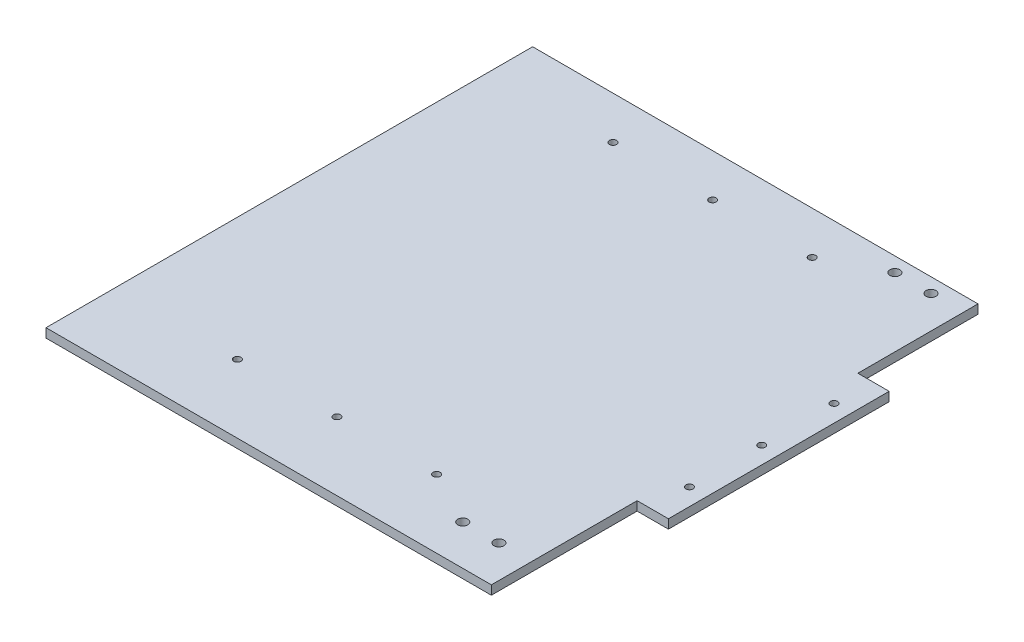
ISO-10303-21;
HEADER;
FILE_DESCRIPTION(('STEP AP214'),'2;1');
FILE_NAME('part.step','',(''),(''),'','','');
FILE_SCHEMA(('AUTOMOTIVE_DESIGN { 1 0 10303 214 1 1 1 1 }'));
ENDSEC;
DATA;
#1=APPLICATION_CONTEXT('core data for automotive mechanical design processes');
#2=APPLICATION_PROTOCOL_DEFINITION('international standard','automotive_design',2000,#1);
#3=PRODUCT_CONTEXT('',#1,'mechanical');
#4=PRODUCT('Part','Part','',(#3));
#5=PRODUCT_RELATED_PRODUCT_CATEGORY('part','',(#4));
#6=PRODUCT_DEFINITION_FORMATION('','',#4);
#7=PRODUCT_DEFINITION_CONTEXT('part definition',#1,'design');
#8=PRODUCT_DEFINITION('design','',#6,#7);
#9=PRODUCT_DEFINITION_SHAPE('','',#8);
#10=(LENGTH_UNIT() NAMED_UNIT(*) SI_UNIT(.MILLI.,.METRE.));
#11=(NAMED_UNIT(*) PLANE_ANGLE_UNIT() SI_UNIT($,.RADIAN.));
#12=(NAMED_UNIT(*) SI_UNIT($,.STERADIAN.) SOLID_ANGLE_UNIT());
#13=UNCERTAINTY_MEASURE_WITH_UNIT(LENGTH_MEASURE(1.E-05),#10,'distance_accuracy_value','');
#14=(GEOMETRIC_REPRESENTATION_CONTEXT(3) GLOBAL_UNCERTAINTY_ASSIGNED_CONTEXT((#13)) GLOBAL_UNIT_ASSIGNED_CONTEXT((#10,
#11,#12)) REPRESENTATION_CONTEXT('',''));
#15=CARTESIAN_POINT('',(0.,0.,0.));
#16=DIRECTION('',(0.,0.,1.));
#17=DIRECTION('',(1.,0.,0.));
#18=AXIS2_PLACEMENT_3D('',#15,#16,#17);
#19=CARTESIAN_POINT('',(156.499999999998,-6.35,171.));
#20=DIRECTION('',(1.,0.,0.));
#21=DIRECTION('',(0.,0.,-1.));
#22=AXIS2_PLACEMENT_3D('',#19,#20,#21);
#23=PLANE('',#22);
#24=DIRECTION('',(0.,0.,-1.));
#25=VECTOR('',#24,1.);
#26=CARTESIAN_POINT('',(156.499999999998,-6.35,171.));
#27=LINE('',#26,#25);
#28=CARTESIAN_POINT('',(156.499999999998,-6.35,171.));
#29=VERTEX_POINT('',#28);
#30=CARTESIAN_POINT('',(156.499999999998,-6.35,68.570201764885));
#31=VERTEX_POINT('',#30);
#32=EDGE_CURVE('E148',#29,#31,#27,.T.);
#33=ORIENTED_EDGE('',*,*,#32,.T.);
#34=DIRECTION('',(0.,1.,0.));
#35=VECTOR('',#34,1.);
#36=CARTESIAN_POINT('',(156.499999999998,-6.35,68.570201764885));
#37=LINE('',#36,#35);
#38=CARTESIAN_POINT('',(156.499999999998,0.,68.570201764885));
#39=VERTEX_POINT('',#38);
#40=EDGE_CURVE('E130',#31,#39,#37,.T.);
#41=ORIENTED_EDGE('',*,*,#40,.T.);
#42=DIRECTION('',(0.,0.,-1.));
#43=VECTOR('',#42,1.);
#44=CARTESIAN_POINT('',(156.499999999998,0.,171.));
#45=LINE('',#44,#43);
#46=CARTESIAN_POINT('',(156.499999999998,0.,171.));
#47=VERTEX_POINT('',#46);
#48=EDGE_CURVE('E158',#47,#39,#45,.T.);
#49=ORIENTED_EDGE('',*,*,#48,.F.);
#50=DIRECTION('',(0.,1.,0.));
#51=VECTOR('',#50,1.);
#52=CARTESIAN_POINT('',(156.499999999998,-6.35,171.));
#53=LINE('',#52,#51);
#54=EDGE_CURVE('E11',#29,#47,#53,.T.);
#55=ORIENTED_EDGE('',*,*,#54,.F.);
#56=EDGE_LOOP('',(#33,#41,#49,#55));
#57=FACE_BOUND('',#56,.T.);
#58=ADVANCED_FACE('F37',(#57),#23,.T.);
#59=DIRECTION('',(0.,1.,0.));
#60=VECTOR('',#59,1.);
#61=CARTESIAN_POINT('',(156.499999999998,-6.35,-86.570201764878));
#62=LINE('',#61,#60);
#63=CARTESIAN_POINT('',(156.499999999998,-6.35,-86.570201764878));
#64=VERTEX_POINT('',#63);
#65=CARTESIAN_POINT('',(156.499999999998,0.,-86.570201764878));
#66=VERTEX_POINT('',#65);
#67=EDGE_CURVE('E145',#64,#66,#62,.T.);
#68=ORIENTED_EDGE('',*,*,#67,.F.);
#69=CARTESIAN_POINT('',(156.499999999998,-6.35,-171.));
#70=VERTEX_POINT('',#69);
#71=EDGE_CURVE('E88',#64,#70,#27,.T.);
#72=ORIENTED_EDGE('',*,*,#71,.T.);
#73=DIRECTION('',(0.,1.,0.));
#74=VECTOR('',#73,1.);
#75=CARTESIAN_POINT('',(156.499999999998,-6.35,-171.));
#76=LINE('',#75,#74);
#77=CARTESIAN_POINT('',(156.499999999998,0.,-171.));
#78=VERTEX_POINT('',#77);
#79=EDGE_CURVE('E41',#70,#78,#76,.T.);
#80=ORIENTED_EDGE('',*,*,#79,.T.);
#81=EDGE_CURVE('E144',#66,#78,#45,.T.);
#82=ORIENTED_EDGE('',*,*,#81,.F.);
#83=EDGE_LOOP('',(#68,#72,#80,#82));
#84=FACE_BOUND('',#83,.T.);
#85=ADVANCED_FACE('F39',(#84),#23,.T.);
#86=CARTESIAN_POINT('',(-156.500000000002,-6.35,171.));
#87=DIRECTION('',(0.,0.,1.));
#88=DIRECTION('',(1.,0.,0.));
#89=AXIS2_PLACEMENT_3D('',#86,#87,#88);
#90=PLANE('',#89);
#91=DIRECTION('',(1.,0.,0.));
#92=VECTOR('',#91,1.);
#93=CARTESIAN_POINT('',(-156.500000000002,0.,171.));
#94=LINE('',#93,#92);
#95=CARTESIAN_POINT('',(-156.500000000002,0.,171.));
#96=VERTEX_POINT('',#95);
#97=EDGE_CURVE('E167',#96,#47,#94,.T.);
#98=ORIENTED_EDGE('',*,*,#97,.F.);
#99=DIRECTION('',(0.,1.,0.));
#100=VECTOR('',#99,1.);
#101=CARTESIAN_POINT('',(-156.500000000002,-6.35,171.));
#102=LINE('',#101,#100);
#103=CARTESIAN_POINT('',(-156.500000000002,-6.35,171.));
#104=VERTEX_POINT('',#103);
#105=EDGE_CURVE('E46',#104,#96,#102,.T.);
#106=ORIENTED_EDGE('',*,*,#105,.F.);
#107=DIRECTION('',(1.,0.,0.));
#108=VECTOR('',#107,1.);
#109=CARTESIAN_POINT('',(-156.500000000002,-6.35,171.));
#110=LINE('',#109,#108);
#111=EDGE_CURVE('E156',#104,#29,#110,.T.);
#112=ORIENTED_EDGE('',*,*,#111,.T.);
#113=ORIENTED_EDGE('',*,*,#54,.T.);
#114=EDGE_LOOP('',(#98,#106,#112,#113));
#115=FACE_BOUND('',#114,.T.);
#116=ADVANCED_FACE('F187',(#115),#90,.T.);
#117=CARTESIAN_POINT('',(-156.500000000002,-6.35,171.));
#118=DIRECTION('',(-1.,0.,0.));
#119=DIRECTION('',(0.,0.,1.));
#120=AXIS2_PLACEMENT_3D('',#117,#118,#119);
#121=PLANE('',#120);
#122=DIRECTION('',(0.,0.,1.));
#123=VECTOR('',#122,1.);
#124=CARTESIAN_POINT('',(-156.500000000002,0.,171.));
#125=LINE('',#124,#123);
#126=CARTESIAN_POINT('',(-156.500000000002,0.,-171.));
#127=VERTEX_POINT('',#126);
#128=EDGE_CURVE('E164',#127,#96,#125,.T.);
#129=ORIENTED_EDGE('',*,*,#128,.F.);
#130=DIRECTION('',(0.,1.,0.));
#131=VECTOR('',#130,1.);
#132=CARTESIAN_POINT('',(-156.500000000002,-6.35,-171.));
#133=LINE('',#132,#131);
#134=CARTESIAN_POINT('',(-156.500000000002,-6.35,-171.));
#135=VERTEX_POINT('',#134);
#136=EDGE_CURVE('E170',#135,#127,#133,.T.);
#137=ORIENTED_EDGE('',*,*,#136,.F.);
#138=DIRECTION('',(0.,0.,1.));
#139=VECTOR('',#138,1.);
#140=CARTESIAN_POINT('',(-156.500000000002,-6.35,171.));
#141=LINE('',#140,#139);
#142=EDGE_CURVE('E153',#135,#104,#141,.T.);
#143=ORIENTED_EDGE('',*,*,#142,.T.);
#144=ORIENTED_EDGE('',*,*,#105,.T.);
#145=EDGE_LOOP('',(#129,#137,#143,#144));
#146=FACE_BOUND('',#145,.T.);
#147=ADVANCED_FACE('F186',(#146),#121,.T.);
#148=CARTESIAN_POINT('',(-156.500000000002,-6.35,-171.));
#149=DIRECTION('',(0.,0.,-1.));
#150=DIRECTION('',(-1.,0.,0.));
#151=AXIS2_PLACEMENT_3D('',#148,#149,#150);
#152=PLANE('',#151);
#153=DIRECTION('',(-1.,0.,0.));
#154=VECTOR('',#153,1.);
#155=CARTESIAN_POINT('',(-156.500000000002,0.,-171.));
#156=LINE('',#155,#154);
#157=EDGE_CURVE('E161',#78,#127,#156,.T.);
#158=ORIENTED_EDGE('',*,*,#157,.F.);
#159=ORIENTED_EDGE('',*,*,#79,.F.);
#160=DIRECTION('',(-1.,0.,0.));
#161=VECTOR('',#160,1.);
#162=CARTESIAN_POINT('',(-156.500000000002,-6.35,-171.));
#163=LINE('',#162,#161);
#164=EDGE_CURVE('E150',#70,#135,#163,.T.);
#165=ORIENTED_EDGE('',*,*,#164,.T.);
#166=ORIENTED_EDGE('',*,*,#136,.T.);
#167=EDGE_LOOP('',(#158,#159,#165,#166));
#168=FACE_BOUND('',#167,.T.);
#169=ADVANCED_FACE('F176',(#168),#152,.T.);
#170=CARTESIAN_POINT('',(0.,-6.35,0.));
#171=DIRECTION('',(0.,-1.,0.));
#172=DIRECTION('',(0.,0.,-1.));
#173=AXIS2_PLACEMENT_3D('',#170,#171,#172);
#174=PLANE('',#173);
#175=CARTESIAN_POINT('',(133.639999999999,-6.35000000000039,-160.839999999994));
#176=DIRECTION('',(0.,-1.,0.));
#177=DIRECTION('',(0.,0.,-1.));
#178=AXIS2_PLACEMENT_3D('',#175,#176,#177);
#179=CIRCLE('',#178,3.49999999999999);
#180=CARTESIAN_POINT('',(133.639999999999,-6.35000000000026,-164.339999999994));
#181=VERTEX_POINT('',#180);
#182=EDGE_CURVE('E275',#181,#181,#179,.T.);
#183=ORIENTED_EDGE('',*,*,#182,.F.);
#184=EDGE_LOOP('',(#183));
#185=FACE_BOUND('',#184,.T.);
#186=CARTESIAN_POINT('',(108.239999999999,-6.35000000000039,-160.839999999994));
#187=DIRECTION('',(0.,-1.,0.));
#188=DIRECTION('',(0.,0.,-1.));
#189=AXIS2_PLACEMENT_3D('',#186,#187,#188);
#190=CIRCLE('',#189,3.50000000000001);
#191=CARTESIAN_POINT('',(108.239999999999,-6.35000000000026,-164.339999999994));
#192=VERTEX_POINT('',#191);
#193=EDGE_CURVE('E279',#192,#192,#190,.T.);
#194=ORIENTED_EDGE('',*,*,#193,.F.);
#195=EDGE_LOOP('',(#194));
#196=FACE_BOUND('',#195,.T.);
#197=CARTESIAN_POINT('',(133.639999999998,-6.35,142.84));
#198=DIRECTION('',(0.,1.,0.));
#199=DIRECTION('',(0.,0.,1.));
#200=AXIS2_PLACEMENT_3D('',#197,#198,#199);
#201=CIRCLE('',#200,3.49999999999999);
#202=CARTESIAN_POINT('',(133.639999999998,-6.35,146.34));
#203=VERTEX_POINT('',#202);
#204=EDGE_CURVE('E289',#203,#203,#201,.T.);
#205=ORIENTED_EDGE('',*,*,#204,.T.);
#206=EDGE_LOOP('',(#205));
#207=FACE_BOUND('',#206,.T.);
#208=CARTESIAN_POINT('',(108.239999999998,-6.35,142.84));
#209=DIRECTION('',(0.,1.,0.));
#210=DIRECTION('',(0.,0.,1.));
#211=AXIS2_PLACEMENT_3D('',#208,#209,#210);
#212=CIRCLE('',#211,3.50000000000001);
#213=CARTESIAN_POINT('',(108.239999999998,-6.35,146.34));
#214=VERTEX_POINT('',#213);
#215=EDGE_CURVE('E281',#214,#214,#212,.T.);
#216=ORIENTED_EDGE('',*,*,#215,.T.);
#217=EDGE_LOOP('',(#216));
#218=FACE_BOUND('',#217,.T.);
#219=CARTESIAN_POINT('',(-70.,-6.35,123.000000000004));
#220=DIRECTION('',(0.,1.,0.));
#221=DIRECTION('',(0.,0.,1.));
#222=AXIS2_PLACEMENT_3D('',#219,#220,#221);
#223=CIRCLE('',#222,2.5);
#224=CARTESIAN_POINT('',(-70.,-6.35,125.500000000004));
#225=VERTEX_POINT('',#224);
#226=EDGE_CURVE('E311',#225,#225,#223,.T.);
#227=ORIENTED_EDGE('',*,*,#226,.T.);
#228=EDGE_LOOP('',(#227));
#229=FACE_BOUND('',#228,.T.);
#230=CARTESIAN_POINT('',(70.,-6.35,123.000000000004));
#231=DIRECTION('',(0.,1.,0.));
#232=DIRECTION('',(0.,0.,-1.));
#233=AXIS2_PLACEMENT_3D('',#230,#231,#232);
#234=CIRCLE('',#233,2.5);
#235=CARTESIAN_POINT('',(70.,-6.35,120.500000000004));
#236=VERTEX_POINT('',#235);
#237=EDGE_CURVE('E317',#236,#236,#234,.T.);
#238=ORIENTED_EDGE('',*,*,#237,.T.);
#239=EDGE_LOOP('',(#238));
#240=FACE_BOUND('',#239,.T.);
#241=CARTESIAN_POINT('',(-70.,-6.35,-140.999999999996));
#242=DIRECTION('',(0.,1.,0.));
#243=DIRECTION('',(0.,0.,-1.));
#244=AXIS2_PLACEMENT_3D('',#241,#242,#243);
#245=CIRCLE('',#244,2.5);
#246=CARTESIAN_POINT('',(-70.,-6.35,-143.499999999996));
#247=VERTEX_POINT('',#246);
#248=EDGE_CURVE('E323',#247,#247,#245,.T.);
#249=ORIENTED_EDGE('',*,*,#248,.T.);
#250=EDGE_LOOP('',(#249));
#251=FACE_BOUND('',#250,.T.);
#252=CARTESIAN_POINT('',(0.,-6.35,-140.999999999996));
#253=DIRECTION('',(0.,1.,0.));
#254=DIRECTION('',(0.,0.,-1.));
#255=AXIS2_PLACEMENT_3D('',#252,#253,#254);
#256=CIRCLE('',#255,2.49999999999999);
#257=CARTESIAN_POINT('',(0.,-6.35,-143.499999999996));
#258=VERTEX_POINT('',#257);
#259=EDGE_CURVE('E304',#258,#258,#256,.T.);
#260=ORIENTED_EDGE('',*,*,#259,.T.);
#261=EDGE_LOOP('',(#260));
#262=FACE_BOUND('',#261,.T.);
#263=CARTESIAN_POINT('',(70.,-6.35,-140.999999999996));
#264=DIRECTION('',(0.,1.,0.));
#265=DIRECTION('',(0.,0.,1.));
#266=AXIS2_PLACEMENT_3D('',#263,#264,#265);
#267=CIRCLE('',#266,2.5);
#268=CARTESIAN_POINT('',(70.,-6.35,-138.499999999996));
#269=VERTEX_POINT('',#268);
#270=EDGE_CURVE('E292',#269,#269,#267,.T.);
#271=ORIENTED_EDGE('',*,*,#270,.T.);
#272=EDGE_LOOP('',(#271));
#273=FACE_BOUND('',#272,.T.);
#274=CARTESIAN_POINT('',(0.,-6.35,123.000000000004));
#275=DIRECTION('',(0.,1.,0.));
#276=DIRECTION('',(0.,0.,1.));
#277=AXIS2_PLACEMENT_3D('',#274,#275,#276);
#278=CIRCLE('',#277,2.5);
#279=CARTESIAN_POINT('',(0.,-6.35,125.500000000004));
#280=VERTEX_POINT('',#279);
#281=EDGE_CURVE('E331',#280,#280,#278,.T.);
#282=ORIENTED_EDGE('',*,*,#281,.T.);
#283=EDGE_LOOP('',(#282));
#284=FACE_BOUND('',#283,.T.);
#285=ORIENTED_EDGE('',*,*,#32,.F.);
#286=ORIENTED_EDGE('',*,*,#111,.F.);
#287=ORIENTED_EDGE('',*,*,#142,.F.);
#288=ORIENTED_EDGE('',*,*,#164,.F.);
#289=ORIENTED_EDGE('',*,*,#71,.F.);
#290=DIRECTION('',(-1.,0.,0.));
#291=VECTOR('',#290,1.);
#292=CARTESIAN_POINT('',(178.499999999998,-6.35,-86.570201764878));
#293=LINE('',#292,#291);
#294=CARTESIAN_POINT('',(178.499999999998,-6.35,-86.570201764878));
#295=VERTEX_POINT('',#294);
#296=EDGE_CURVE('E120',#295,#64,#293,.T.);
#297=ORIENTED_EDGE('',*,*,#296,.F.);
#298=DIRECTION('',(0.,0.,-1.));
#299=VECTOR('',#298,1.);
#300=CARTESIAN_POINT('',(178.499999999998,-6.35,68.570201764885));
#301=LINE('',#300,#299);
#302=CARTESIAN_POINT('',(178.499999999998,-6.35,68.570201764885));
#303=VERTEX_POINT('',#302);
#304=EDGE_CURVE('E115',#303,#295,#301,.T.);
#305=ORIENTED_EDGE('',*,*,#304,.F.);
#306=DIRECTION('',(1.,0.,0.));
#307=VECTOR('',#306,1.);
#308=CARTESIAN_POINT('',(156.499999999998,-6.35,68.570201764885));
#309=LINE('',#308,#307);
#310=EDGE_CURVE('E127',#31,#303,#309,.T.);
#311=ORIENTED_EDGE('',*,*,#310,.F.);
#312=EDGE_LOOP('',(#285,#286,#287,#288,#289,#297,#305,#311));
#313=FACE_BOUND('',#312,.T.);
#314=CARTESIAN_POINT('',(166.499999999998,-6.35,-59.7999999999965));
#315=DIRECTION('',(0.,1.,0.));
#316=DIRECTION('',(0.,0.,-1.));
#317=AXIS2_PLACEMENT_3D('',#314,#315,#316);
#318=CIRCLE('',#317,2.5);
#319=CARTESIAN_POINT('',(166.499999999998,-6.35,-62.2999999999965));
#320=VERTEX_POINT('',#319);
#321=EDGE_CURVE('E337',#320,#320,#318,.T.);
#322=ORIENTED_EDGE('',*,*,#321,.T.);
#323=EDGE_LOOP('',(#322));
#324=FACE_BOUND('',#323,.T.);
#325=CARTESIAN_POINT('',(166.499999999998,-6.35,41.8000000000035));
#326=DIRECTION('',(0.,1.,0.));
#327=DIRECTION('',(0.,0.,1.));
#328=AXIS2_PLACEMENT_3D('',#325,#326,#327);
#329=CIRCLE('',#328,2.5);
#330=CARTESIAN_POINT('',(166.499999999998,-6.35,44.3000000000035));
#331=VERTEX_POINT('',#330);
#332=EDGE_CURVE('E343',#331,#331,#329,.T.);
#333=ORIENTED_EDGE('',*,*,#332,.T.);
#334=EDGE_LOOP('',(#333));
#335=FACE_BOUND('',#334,.T.);
#336=CARTESIAN_POINT('',(166.499999999998,-6.35,-8.99999999999648));
#337=DIRECTION('',(0.,1.,0.));
#338=DIRECTION('',(0.,0.,1.));
#339=AXIS2_PLACEMENT_3D('',#336,#337,#338);
#340=CIRCLE('',#339,2.5);
#341=CARTESIAN_POINT('',(166.499999999998,-6.35,-6.49999999999649));
#342=VERTEX_POINT('',#341);
#343=EDGE_CURVE('E141',#342,#342,#340,.T.);
#344=ORIENTED_EDGE('',*,*,#343,.T.);
#345=EDGE_LOOP('',(#344));
#346=FACE_BOUND('',#345,.T.);
#347=ADVANCED_FACE('F125',(#185,#196,#207,#218,#229,#240,#251,#262,#273,#284,#313,#324,#335,
#346),#174,.T.);
#348=CARTESIAN_POINT('',(0.,0.,0.));
#349=DIRECTION('',(0.,-1.,0.));
#350=DIRECTION('',(0.,0.,-1.));
#351=AXIS2_PLACEMENT_3D('',#348,#349,#350);
#352=PLANE('',#351);
#353=CARTESIAN_POINT('',(133.639999999999,5.83162409271444E-12,-160.839999999993));
#354=DIRECTION('',(0.,-1.,0.));
#355=DIRECTION('',(0.,0.,-1.));
#356=AXIS2_PLACEMENT_3D('',#353,#354,#355);
#357=CIRCLE('',#356,3.49999999999999);
#358=CARTESIAN_POINT('',(133.639999999999,5.96604640781258E-12,-164.339999999993));
#359=VERTEX_POINT('',#358);
#360=EDGE_CURVE('E278',#359,#359,#357,.T.);
#361=ORIENTED_EDGE('',*,*,#360,.T.);
#362=EDGE_LOOP('',(#361));
#363=FACE_BOUND('',#362,.T.);
#364=CARTESIAN_POINT('',(108.239999999999,5.83162409271444E-12,-160.839999999994));
#365=DIRECTION('',(0.,-1.,0.));
#366=DIRECTION('',(0.,0.,-1.));
#367=AXIS2_PLACEMENT_3D('',#364,#365,#366);
#368=CIRCLE('',#367,3.50000000000001);
#369=CARTESIAN_POINT('',(108.239999999999,5.96604640781258E-12,-164.339999999994));
#370=VERTEX_POINT('',#369);
#371=EDGE_CURVE('E284',#370,#370,#368,.T.);
#372=ORIENTED_EDGE('',*,*,#371,.T.);
#373=EDGE_LOOP('',(#372));
#374=FACE_BOUND('',#373,.T.);
#375=CARTESIAN_POINT('',(133.639999999998,0.,142.84));
#376=DIRECTION('',(0.,1.,0.));
#377=DIRECTION('',(0.,0.,1.));
#378=AXIS2_PLACEMENT_3D('',#375,#376,#377);
#379=CIRCLE('',#378,3.49999999999999);
#380=CARTESIAN_POINT('',(133.639999999998,0.,146.34));
#381=VERTEX_POINT('',#380);
#382=EDGE_CURVE('E293',#381,#381,#379,.T.);
#383=ORIENTED_EDGE('',*,*,#382,.F.);
#384=EDGE_LOOP('',(#383));
#385=FACE_BOUND('',#384,.T.);
#386=CARTESIAN_POINT('',(108.239999999998,0.,142.84));
#387=DIRECTION('',(0.,1.,0.));
#388=DIRECTION('',(0.,0.,1.));
#389=AXIS2_PLACEMENT_3D('',#386,#387,#388);
#390=CIRCLE('',#389,3.50000000000001);
#391=CARTESIAN_POINT('',(108.239999999998,0.,146.34));
#392=VERTEX_POINT('',#391);
#393=EDGE_CURVE('E296',#392,#392,#390,.T.);
#394=ORIENTED_EDGE('',*,*,#393,.F.);
#395=EDGE_LOOP('',(#394));
#396=FACE_BOUND('',#395,.T.);
#397=CARTESIAN_POINT('',(-70.,0.,123.000000000004));
#398=DIRECTION('',(0.,1.,0.));
#399=DIRECTION('',(0.,0.,1.));
#400=AXIS2_PLACEMENT_3D('',#397,#398,#399);
#401=CIRCLE('',#400,2.5);
#402=CARTESIAN_POINT('',(-70.,0.,125.500000000004));
#403=VERTEX_POINT('',#402);
#404=EDGE_CURVE('E307',#403,#403,#401,.T.);
#405=ORIENTED_EDGE('',*,*,#404,.F.);
#406=EDGE_LOOP('',(#405));
#407=FACE_BOUND('',#406,.T.);
#408=CARTESIAN_POINT('',(70.,0.,123.000000000004));
#409=DIRECTION('',(0.,1.,0.));
#410=DIRECTION('',(0.,0.,-1.));
#411=AXIS2_PLACEMENT_3D('',#408,#409,#410);
#412=CIRCLE('',#411,2.5);
#413=CARTESIAN_POINT('',(70.,0.,120.500000000004));
#414=VERTEX_POINT('',#413);
#415=EDGE_CURVE('E314',#414,#414,#412,.T.);
#416=ORIENTED_EDGE('',*,*,#415,.F.);
#417=EDGE_LOOP('',(#416));
#418=FACE_BOUND('',#417,.T.);
#419=CARTESIAN_POINT('',(-70.,0.,-140.999999999996));
#420=DIRECTION('',(0.,1.,0.));
#421=DIRECTION('',(0.,0.,-1.));
#422=AXIS2_PLACEMENT_3D('',#419,#420,#421);
#423=CIRCLE('',#422,2.5);
#424=CARTESIAN_POINT('',(-70.,0.,-143.499999999996));
#425=VERTEX_POINT('',#424);
#426=EDGE_CURVE('E320',#425,#425,#423,.T.);
#427=ORIENTED_EDGE('',*,*,#426,.F.);
#428=EDGE_LOOP('',(#427));
#429=FACE_BOUND('',#428,.T.);
#430=CARTESIAN_POINT('',(0.,0.,-140.999999999996));
#431=DIRECTION('',(0.,1.,0.));
#432=DIRECTION('',(0.,0.,-1.));
#433=AXIS2_PLACEMENT_3D('',#430,#431,#432);
#434=CIRCLE('',#433,2.49999999999999);
#435=CARTESIAN_POINT('',(0.,0.,-143.499999999996));
#436=VERTEX_POINT('',#435);
#437=EDGE_CURVE('E326',#436,#436,#434,.T.);
#438=ORIENTED_EDGE('',*,*,#437,.F.);
#439=EDGE_LOOP('',(#438));
#440=FACE_BOUND('',#439,.T.);
#441=CARTESIAN_POINT('',(70.,0.,-140.999999999996));
#442=DIRECTION('',(0.,1.,0.));
#443=DIRECTION('',(0.,0.,1.));
#444=AXIS2_PLACEMENT_3D('',#441,#442,#443);
#445=CIRCLE('',#444,2.5);
#446=CARTESIAN_POINT('',(70.,0.,-138.499999999996));
#447=VERTEX_POINT('',#446);
#448=EDGE_CURVE('E301',#447,#447,#445,.T.);
#449=ORIENTED_EDGE('',*,*,#448,.F.);
#450=EDGE_LOOP('',(#449));
#451=FACE_BOUND('',#450,.T.);
#452=CARTESIAN_POINT('',(0.,0.,123.000000000004));
#453=DIRECTION('',(0.,1.,0.));
#454=DIRECTION('',(0.,0.,1.));
#455=AXIS2_PLACEMENT_3D('',#452,#453,#454);
#456=CIRCLE('',#455,2.5);
#457=CARTESIAN_POINT('',(0.,0.,125.500000000004));
#458=VERTEX_POINT('',#457);
#459=EDGE_CURVE('E310',#458,#458,#456,.T.);
#460=ORIENTED_EDGE('',*,*,#459,.F.);
#461=EDGE_LOOP('',(#460));
#462=FACE_BOUND('',#461,.T.);
#463=ORIENTED_EDGE('',*,*,#48,.T.);
#464=DIRECTION('',(1.,0.,0.));
#465=VECTOR('',#464,1.);
#466=CARTESIAN_POINT('',(156.499999999998,0.,68.570201764885));
#467=LINE('',#466,#465);
#468=CARTESIAN_POINT('',(178.499999999998,0.,68.570201764885));
#469=VERTEX_POINT('',#468);
#470=EDGE_CURVE('E54',#39,#469,#467,.T.);
#471=ORIENTED_EDGE('',*,*,#470,.T.);
#472=DIRECTION('',(0.,0.,-1.));
#473=VECTOR('',#472,1.);
#474=CARTESIAN_POINT('',(178.499999999998,0.,68.570201764885));
#475=LINE('',#474,#473);
#476=CARTESIAN_POINT('',(178.499999999998,0.,-86.570201764878));
#477=VERTEX_POINT('',#476);
#478=EDGE_CURVE('E117',#469,#477,#475,.T.);
#479=ORIENTED_EDGE('',*,*,#478,.T.);
#480=DIRECTION('',(-1.,0.,0.));
#481=VECTOR('',#480,1.);
#482=CARTESIAN_POINT('',(178.499999999998,0.,-86.570201764878));
#483=LINE('',#482,#481);
#484=EDGE_CURVE('E131',#477,#66,#483,.T.);
#485=ORIENTED_EDGE('',*,*,#484,.T.);
#486=ORIENTED_EDGE('',*,*,#81,.T.);
#487=ORIENTED_EDGE('',*,*,#157,.T.);
#488=ORIENTED_EDGE('',*,*,#128,.T.);
#489=ORIENTED_EDGE('',*,*,#97,.T.);
#490=EDGE_LOOP('',(#463,#471,#479,#485,#486,#487,#488,#489));
#491=FACE_BOUND('',#490,.T.);
#492=CARTESIAN_POINT('',(166.499999999998,0.,-59.7999999999965));
#493=DIRECTION('',(0.,1.,0.));
#494=DIRECTION('',(0.,0.,-1.));
#495=AXIS2_PLACEMENT_3D('',#492,#493,#494);
#496=CIRCLE('',#495,2.5);
#497=CARTESIAN_POINT('',(166.499999999998,0.,-62.2999999999965));
#498=VERTEX_POINT('',#497);
#499=EDGE_CURVE('E334',#498,#498,#496,.T.);
#500=ORIENTED_EDGE('',*,*,#499,.F.);
#501=EDGE_LOOP('',(#500));
#502=FACE_BOUND('',#501,.T.);
#503=CARTESIAN_POINT('',(166.499999999998,0.,41.8000000000035));
#504=DIRECTION('',(0.,1.,0.));
#505=DIRECTION('',(0.,0.,1.));
#506=AXIS2_PLACEMENT_3D('',#503,#504,#505);
#507=CIRCLE('',#506,2.5);
#508=CARTESIAN_POINT('',(166.499999999998,0.,44.3000000000035));
#509=VERTEX_POINT('',#508);
#510=EDGE_CURVE('E340',#509,#509,#507,.T.);
#511=ORIENTED_EDGE('',*,*,#510,.F.);
#512=EDGE_LOOP('',(#511));
#513=FACE_BOUND('',#512,.T.);
#514=CARTESIAN_POINT('',(166.499999999998,0.,-8.99999999999648));
#515=DIRECTION('',(0.,1.,0.));
#516=DIRECTION('',(0.,0.,1.));
#517=AXIS2_PLACEMENT_3D('',#514,#515,#516);
#518=CIRCLE('',#517,2.5);
#519=CARTESIAN_POINT('',(166.499999999998,0.,-6.49999999999649));
#520=VERTEX_POINT('',#519);
#521=EDGE_CURVE('E136',#520,#520,#518,.T.);
#522=ORIENTED_EDGE('',*,*,#521,.F.);
#523=EDGE_LOOP('',(#522));
#524=FACE_BOUND('',#523,.T.);
#525=ADVANCED_FACE('F178',(#363,#374,#385,#396,#407,#418,#429,#440,#451,#462,#491,#502,#513,
#524),#352,.F.);
#526=CARTESIAN_POINT('',(156.499999999998,-6.35,68.570201764885));
#527=DIRECTION('',(0.,0.,1.));
#528=DIRECTION('',(1.,0.,0.));
#529=AXIS2_PLACEMENT_3D('',#526,#527,#528);
#530=PLANE('',#529);
#531=ORIENTED_EDGE('',*,*,#470,.F.);
#532=ORIENTED_EDGE('',*,*,#40,.F.);
#533=ORIENTED_EDGE('',*,*,#310,.T.);
#534=DIRECTION('',(0.,1.,0.));
#535=VECTOR('',#534,1.);
#536=CARTESIAN_POINT('',(178.499999999998,-6.35,68.570201764885));
#537=LINE('',#536,#535);
#538=EDGE_CURVE('E112',#303,#469,#537,.T.);
#539=ORIENTED_EDGE('',*,*,#538,.T.);
#540=EDGE_LOOP('',(#531,#532,#533,#539));
#541=FACE_BOUND('',#540,.T.);
#542=ADVANCED_FACE('F129',(#541),#530,.T.);
#543=CARTESIAN_POINT('',(178.499999999998,-6.35,-86.570201764878));
#544=DIRECTION('',(0.,0.,-1.));
#545=DIRECTION('',(-1.,0.,0.));
#546=AXIS2_PLACEMENT_3D('',#543,#544,#545);
#547=PLANE('',#546);
#548=ORIENTED_EDGE('',*,*,#484,.F.);
#549=DIRECTION('',(0.,1.,0.));
#550=VECTOR('',#549,1.);
#551=CARTESIAN_POINT('',(178.499999999998,-6.35,-86.570201764878));
#552=LINE('',#551,#550);
#553=EDGE_CURVE('E119',#295,#477,#552,.T.);
#554=ORIENTED_EDGE('',*,*,#553,.F.);
#555=ORIENTED_EDGE('',*,*,#296,.T.);
#556=ORIENTED_EDGE('',*,*,#67,.T.);
#557=EDGE_LOOP('',(#548,#554,#555,#556));
#558=FACE_BOUND('',#557,.T.);
#559=ADVANCED_FACE('F182',(#558),#547,.T.);
#560=CARTESIAN_POINT('',(178.499999999998,-6.35,68.570201764885));
#561=DIRECTION('',(1.,0.,0.));
#562=DIRECTION('',(0.,0.,-1.));
#563=AXIS2_PLACEMENT_3D('',#560,#561,#562);
#564=PLANE('',#563);
#565=ORIENTED_EDGE('',*,*,#478,.F.);
#566=ORIENTED_EDGE('',*,*,#538,.F.);
#567=ORIENTED_EDGE('',*,*,#304,.T.);
#568=ORIENTED_EDGE('',*,*,#553,.T.);
#569=EDGE_LOOP('',(#565,#566,#567,#568));
#570=FACE_BOUND('',#569,.T.);
#571=ADVANCED_FACE('F114',(#570),#564,.T.);
#572=CARTESIAN_POINT('',(166.499999999998,-6.35,-8.99999999999648));
#573=DIRECTION('',(0.,1.,0.));
#574=DIRECTION('',(0.,0.,1.));
#575=AXIS2_PLACEMENT_3D('',#572,#573,#574);
#576=CYLINDRICAL_SURFACE('',#575,2.5);
#577=ORIENTED_EDGE('',*,*,#343,.F.);
#578=EDGE_LOOP('',(#577));
#579=FACE_BOUND('',#578,.T.);
#580=ORIENTED_EDGE('',*,*,#521,.T.);
#581=EDGE_LOOP('',(#580));
#582=FACE_BOUND('',#581,.T.);
#583=ADVANCED_FACE('F218',(#579,#582),#576,.F.);
#584=CARTESIAN_POINT('',(166.499999999998,-6.35,41.8000000000035));
#585=DIRECTION('',(0.,1.,0.));
#586=DIRECTION('',(0.,0.,1.));
#587=AXIS2_PLACEMENT_3D('',#584,#585,#586);
#588=CYLINDRICAL_SURFACE('',#587,2.5);
#589=ORIENTED_EDGE('',*,*,#332,.F.);
#590=EDGE_LOOP('',(#589));
#591=FACE_BOUND('',#590,.T.);
#592=ORIENTED_EDGE('',*,*,#510,.T.);
#593=EDGE_LOOP('',(#592));
#594=FACE_BOUND('',#593,.T.);
#595=ADVANCED_FACE('F223',(#591,#594),#588,.F.);
#596=CARTESIAN_POINT('',(166.499999999998,-6.35,-59.7999999999965));
#597=DIRECTION('',(0.,1.,0.));
#598=DIRECTION('',(0.,0.,1.));
#599=AXIS2_PLACEMENT_3D('',#596,#597,#598);
#600=CYLINDRICAL_SURFACE('',#599,2.5);
#601=ORIENTED_EDGE('',*,*,#321,.F.);
#602=EDGE_LOOP('',(#601));
#603=FACE_BOUND('',#602,.T.);
#604=ORIENTED_EDGE('',*,*,#499,.T.);
#605=EDGE_LOOP('',(#604));
#606=FACE_BOUND('',#605,.T.);
#607=ADVANCED_FACE('F227',(#603,#606),#600,.F.);
#608=CARTESIAN_POINT('',(0.,-6.35,123.000000000004));
#609=DIRECTION('',(0.,1.,0.));
#610=DIRECTION('',(0.,0.,1.));
#611=AXIS2_PLACEMENT_3D('',#608,#609,#610);
#612=CYLINDRICAL_SURFACE('',#611,2.5);
#613=ORIENTED_EDGE('',*,*,#281,.F.);
#614=EDGE_LOOP('',(#613));
#615=FACE_BOUND('',#614,.T.);
#616=ORIENTED_EDGE('',*,*,#459,.T.);
#617=EDGE_LOOP('',(#616));
#618=FACE_BOUND('',#617,.T.);
#619=ADVANCED_FACE('F231',(#615,#618),#612,.F.);
#620=CARTESIAN_POINT('',(70.,-6.35,-140.999999999996));
#621=DIRECTION('',(0.,1.,0.));
#622=DIRECTION('',(0.,0.,1.));
#623=AXIS2_PLACEMENT_3D('',#620,#621,#622);
#624=CYLINDRICAL_SURFACE('',#623,2.5);
#625=ORIENTED_EDGE('',*,*,#270,.F.);
#626=EDGE_LOOP('',(#625));
#627=FACE_BOUND('',#626,.T.);
#628=ORIENTED_EDGE('',*,*,#448,.T.);
#629=EDGE_LOOP('',(#628));
#630=FACE_BOUND('',#629,.T.);
#631=ADVANCED_FACE('F235',(#627,#630),#624,.F.);
#632=CARTESIAN_POINT('',(0.,-6.35,-140.999999999996));
#633=DIRECTION('',(0.,1.,0.));
#634=DIRECTION('',(0.,0.,1.));
#635=AXIS2_PLACEMENT_3D('',#632,#633,#634);
#636=CYLINDRICAL_SURFACE('',#635,2.49999999999999);
#637=ORIENTED_EDGE('',*,*,#259,.F.);
#638=EDGE_LOOP('',(#637));
#639=FACE_BOUND('',#638,.T.);
#640=ORIENTED_EDGE('',*,*,#437,.T.);
#641=EDGE_LOOP('',(#640));
#642=FACE_BOUND('',#641,.T.);
#643=ADVANCED_FACE('F237',(#639,#642),#636,.F.);
#644=CARTESIAN_POINT('',(-70.,-6.35,-140.999999999996));
#645=DIRECTION('',(0.,1.,0.));
#646=DIRECTION('',(0.,0.,1.));
#647=AXIS2_PLACEMENT_3D('',#644,#645,#646);
#648=CYLINDRICAL_SURFACE('',#647,2.5);
#649=ORIENTED_EDGE('',*,*,#248,.F.);
#650=EDGE_LOOP('',(#649));
#651=FACE_BOUND('',#650,.T.);
#652=ORIENTED_EDGE('',*,*,#426,.T.);
#653=EDGE_LOOP('',(#652));
#654=FACE_BOUND('',#653,.T.);
#655=ADVANCED_FACE('F240',(#651,#654),#648,.F.);
#656=CARTESIAN_POINT('',(70.,-6.35,123.000000000004));
#657=DIRECTION('',(0.,1.,0.));
#658=DIRECTION('',(0.,0.,1.));
#659=AXIS2_PLACEMENT_3D('',#656,#657,#658);
#660=CYLINDRICAL_SURFACE('',#659,2.5);
#661=ORIENTED_EDGE('',*,*,#237,.F.);
#662=EDGE_LOOP('',(#661));
#663=FACE_BOUND('',#662,.T.);
#664=ORIENTED_EDGE('',*,*,#415,.T.);
#665=EDGE_LOOP('',(#664));
#666=FACE_BOUND('',#665,.T.);
#667=ADVANCED_FACE('F244',(#663,#666),#660,.F.);
#668=CARTESIAN_POINT('',(-70.,-6.35,123.000000000004));
#669=DIRECTION('',(0.,1.,0.));
#670=DIRECTION('',(0.,0.,1.));
#671=AXIS2_PLACEMENT_3D('',#668,#669,#670);
#672=CYLINDRICAL_SURFACE('',#671,2.5);
#673=ORIENTED_EDGE('',*,*,#226,.F.);
#674=EDGE_LOOP('',(#673));
#675=FACE_BOUND('',#674,.T.);
#676=ORIENTED_EDGE('',*,*,#404,.T.);
#677=EDGE_LOOP('',(#676));
#678=FACE_BOUND('',#677,.T.);
#679=ADVANCED_FACE('F248',(#675,#678),#672,.F.);
#680=CARTESIAN_POINT('',(108.239999999998,-6.35,142.84));
#681=DIRECTION('',(0.,1.,0.));
#682=DIRECTION('',(0.,0.,1.));
#683=AXIS2_PLACEMENT_3D('',#680,#681,#682);
#684=CYLINDRICAL_SURFACE('',#683,3.50000000000001);
#685=ORIENTED_EDGE('',*,*,#215,.F.);
#686=EDGE_LOOP('',(#685));
#687=FACE_BOUND('',#686,.T.);
#688=ORIENTED_EDGE('',*,*,#393,.T.);
#689=EDGE_LOOP('',(#688));
#690=FACE_BOUND('',#689,.T.);
#691=ADVANCED_FACE('F252',(#687,#690),#684,.F.);
#692=CARTESIAN_POINT('',(133.639999999998,-6.35,142.84));
#693=DIRECTION('',(0.,1.,0.));
#694=DIRECTION('',(0.,0.,1.));
#695=AXIS2_PLACEMENT_3D('',#692,#693,#694);
#696=CYLINDRICAL_SURFACE('',#695,3.49999999999999);
#697=ORIENTED_EDGE('',*,*,#204,.F.);
#698=EDGE_LOOP('',(#697));
#699=FACE_BOUND('',#698,.T.);
#700=ORIENTED_EDGE('',*,*,#382,.T.);
#701=EDGE_LOOP('',(#700));
#702=FACE_BOUND('',#701,.T.);
#703=ADVANCED_FACE('F259',(#699,#702),#696,.F.);
#704=CARTESIAN_POINT('',(108.239999999999,-6.35000000000039,-160.839999999994));
#705=DIRECTION('',(0.,1.,0.));
#706=DIRECTION('',(0.,0.,1.));
#707=AXIS2_PLACEMENT_3D('',#704,#705,#706);
#708=CYLINDRICAL_SURFACE('',#707,3.50000000000001);
#709=ORIENTED_EDGE('',*,*,#193,.T.);
#710=EDGE_LOOP('',(#709));
#711=FACE_BOUND('',#710,.T.);
#712=ORIENTED_EDGE('',*,*,#371,.F.);
#713=EDGE_LOOP('',(#712));
#714=FACE_BOUND('',#713,.T.);
#715=ADVANCED_FACE('F263',(#711,#714),#708,.F.);
#716=CARTESIAN_POINT('',(133.639999999999,-6.35000000000039,-160.839999999994));
#717=DIRECTION('',(0.,1.,0.));
#718=DIRECTION('',(0.,0.,1.));
#719=AXIS2_PLACEMENT_3D('',#716,#717,#718);
#720=CYLINDRICAL_SURFACE('',#719,3.49999999999999);
#721=ORIENTED_EDGE('',*,*,#182,.T.);
#722=EDGE_LOOP('',(#721));
#723=FACE_BOUND('',#722,.T.);
#724=ORIENTED_EDGE('',*,*,#360,.F.);
#725=EDGE_LOOP('',(#724));
#726=FACE_BOUND('',#725,.T.);
#727=ADVANCED_FACE('F267',(#723,#726),#720,.F.);
#728=CLOSED_SHELL('',(#58,#85,#116,#147,#169,#347,#525,#542,#559,#571,#583,#595,#607,#619,#631,
#643,#655,#667,#679,#691,#703,#715,#727));
#729=MANIFOLD_SOLID_BREP('B2',#728);
#730=ADVANCED_BREP_SHAPE_REPRESENTATION('',(#18,#729),#14);
#731=SHAPE_DEFINITION_REPRESENTATION(#9,#730);
ENDSEC;
END-ISO-10303-21;
